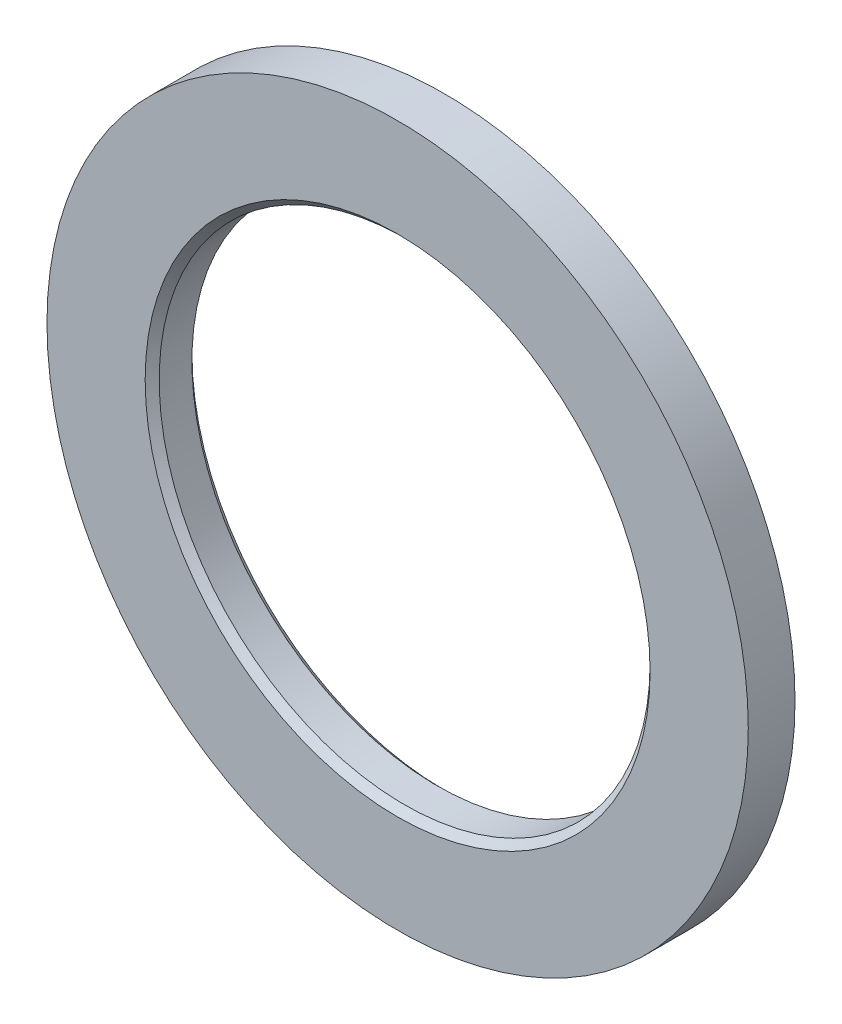
ISO-10303-21;
HEADER;
FILE_DESCRIPTION(('STEP AP214'),'2;1');
FILE_NAME('part.step','',(''),(''),'','','');
FILE_SCHEMA(('AUTOMOTIVE_DESIGN { 1 0 10303 214 1 1 1 1 }'));
ENDSEC;
DATA;
#1=APPLICATION_CONTEXT('core data for automotive mechanical design processes');
#2=APPLICATION_PROTOCOL_DEFINITION('international standard','automotive_design',2000,#1);
#3=PRODUCT_CONTEXT('',#1,'mechanical');
#4=PRODUCT('Part','Part','',(#3));
#5=PRODUCT_RELATED_PRODUCT_CATEGORY('part','',(#4));
#6=PRODUCT_DEFINITION_FORMATION('','',#4);
#7=PRODUCT_DEFINITION_CONTEXT('part definition',#1,'design');
#8=PRODUCT_DEFINITION('design','',#6,#7);
#9=PRODUCT_DEFINITION_SHAPE('','',#8);
#10=(LENGTH_UNIT() NAMED_UNIT(*) SI_UNIT(.MILLI.,.METRE.));
#11=(NAMED_UNIT(*) PLANE_ANGLE_UNIT() SI_UNIT($,.RADIAN.));
#12=(NAMED_UNIT(*) SI_UNIT($,.STERADIAN.) SOLID_ANGLE_UNIT());
#13=UNCERTAINTY_MEASURE_WITH_UNIT(LENGTH_MEASURE(1.E-05),#10,'distance_accuracy_value','');
#14=(GEOMETRIC_REPRESENTATION_CONTEXT(3) GLOBAL_UNCERTAINTY_ASSIGNED_CONTEXT((#13)) GLOBAL_UNIT_ASSIGNED_CONTEXT((#10,
#11,#12)) REPRESENTATION_CONTEXT('',''));
#15=CARTESIAN_POINT('',(0.,0.,0.));
#16=DIRECTION('',(0.,0.,1.));
#17=DIRECTION('',(1.,0.,0.));
#18=AXIS2_PLACEMENT_3D('',#15,#16,#17);
#19=CARTESIAN_POINT('',(0.,0.,5.));
#20=DIRECTION('',(0.,0.,-1.));
#21=DIRECTION('',(-1.,0.,0.));
#22=AXIS2_PLACEMENT_3D('',#19,#20,#21);
#23=CYLINDRICAL_SURFACE('',#22,37.5);
#24=CARTESIAN_POINT('',(0.,0.,5.));
#25=DIRECTION('',(0.,0.,1.));
#26=DIRECTION('',(1.,0.,0.));
#27=AXIS2_PLACEMENT_3D('',#24,#25,#26);
#28=CIRCLE('',#27,37.5);
#29=CARTESIAN_POINT('',(37.5,0.,5.));
#30=VERTEX_POINT('',#29);
#31=EDGE_CURVE('E10',#30,#30,#28,.T.);
#32=ORIENTED_EDGE('',*,*,#31,.F.);
#33=EDGE_LOOP('',(#32));
#34=FACE_BOUND('',#33,.T.);
#35=CARTESIAN_POINT('',(0.,0.,0.));
#36=DIRECTION('',(0.,0.,1.));
#37=DIRECTION('',(1.,0.,0.));
#38=AXIS2_PLACEMENT_3D('',#35,#36,#37);
#39=CIRCLE('',#38,37.5);
#40=CARTESIAN_POINT('',(37.5,0.,0.));
#41=VERTEX_POINT('',#40);
#42=EDGE_CURVE('E36',#41,#41,#39,.T.);
#43=ORIENTED_EDGE('',*,*,#42,.T.);
#44=EDGE_LOOP('',(#43));
#45=FACE_BOUND('',#44,.T.);
#46=ADVANCED_FACE('F33',(#34,#45),#23,.T.);
#47=CARTESIAN_POINT('',(0.,0.,5.));
#48=DIRECTION('',(0.,0.,1.));
#49=DIRECTION('',(1.,0.,0.));
#50=AXIS2_PLACEMENT_3D('',#47,#48,#49);
#51=PLANE('',#50);
#52=CARTESIAN_POINT('',(0.,0.,5.));
#53=DIRECTION('',(0.,0.,1.));
#54=DIRECTION('',(1.,0.,0.));
#55=AXIS2_PLACEMENT_3D('',#52,#53,#54);
#56=CIRCLE('',#55,27.);
#57=CARTESIAN_POINT('',(27.,0.,5.));
#58=VERTEX_POINT('',#57);
#59=EDGE_CURVE('E43',#58,#58,#56,.T.);
#60=ORIENTED_EDGE('',*,*,#59,.F.);
#61=EDGE_LOOP('',(#60));
#62=FACE_BOUND('',#61,.T.);
#63=ORIENTED_EDGE('',*,*,#31,.T.);
#64=EDGE_LOOP('',(#63));
#65=FACE_BOUND('',#64,.T.);
#66=ADVANCED_FACE('F78',(#62,#65),#51,.T.);
#67=CARTESIAN_POINT('',(0.,0.,0.));
#68=DIRECTION('',(0.,0.,1.));
#69=DIRECTION('',(1.,0.,0.));
#70=AXIS2_PLACEMENT_3D('',#67,#68,#69);
#71=PLANE('',#70);
#72=CARTESIAN_POINT('',(0.,0.,0.));
#73=DIRECTION('',(0.,0.,1.));
#74=DIRECTION('',(1.,0.,0.));
#75=AXIS2_PLACEMENT_3D('',#72,#73,#74);
#76=CIRCLE('',#75,27.);
#77=CARTESIAN_POINT('',(27.,0.,0.));
#78=VERTEX_POINT('',#77);
#79=EDGE_CURVE('E53',#78,#78,#76,.T.);
#80=ORIENTED_EDGE('',*,*,#79,.T.);
#81=EDGE_LOOP('',(#80));
#82=FACE_BOUND('',#81,.T.);
#83=ORIENTED_EDGE('',*,*,#42,.F.);
#84=EDGE_LOOP('',(#83));
#85=FACE_BOUND('',#84,.T.);
#86=ADVANCED_FACE('F57',(#82,#85),#71,.F.);
#87=CARTESIAN_POINT('',(0.,0.,0.));
#88=DIRECTION('',(0.,0.,1.));
#89=DIRECTION('',(1.,0.,0.));
#90=AXIS2_PLACEMENT_3D('',#87,#88,#89);
#91=CYLINDRICAL_SURFACE('',#90,26.25);
#92=CARTESIAN_POINT('',(0.,0.,0.750000000000001));
#93=DIRECTION('',(0.,0.,1.));
#94=DIRECTION('',(1.,0.,0.));
#95=AXIS2_PLACEMENT_3D('',#92,#93,#94);
#96=CIRCLE('',#95,26.25);
#97=CARTESIAN_POINT('',(26.25,0.,0.750000000000001));
#98=VERTEX_POINT('',#97);
#99=EDGE_CURVE('E50',#98,#98,#96,.T.);
#100=ORIENTED_EDGE('',*,*,#99,.F.);
#101=EDGE_LOOP('',(#100));
#102=FACE_BOUND('',#101,.T.);
#103=CARTESIAN_POINT('',(0.,0.,4.25));
#104=DIRECTION('',(0.,0.,1.));
#105=DIRECTION('',(1.,0.,0.));
#106=AXIS2_PLACEMENT_3D('',#103,#104,#105);
#107=CIRCLE('',#106,26.25);
#108=CARTESIAN_POINT('',(26.25,0.,4.25));
#109=VERTEX_POINT('',#108);
#110=EDGE_CURVE('E47',#109,#109,#107,.T.);
#111=ORIENTED_EDGE('',*,*,#110,.T.);
#112=EDGE_LOOP('',(#111));
#113=FACE_BOUND('',#112,.T.);
#114=ADVANCED_FACE('F67',(#102,#113),#91,.F.);
#115=CARTESIAN_POINT('',(0.,0.,5.));
#116=DIRECTION('',(0.,0.,1.));
#117=DIRECTION('',(1.,0.,0.));
#118=AXIS2_PLACEMENT_3D('',#115,#116,#117);
#119=CONICAL_SURFACE('',#118,27.,0.785398163397449);
#120=ORIENTED_EDGE('',*,*,#110,.F.);
#121=EDGE_LOOP('',(#120));
#122=FACE_BOUND('',#121,.T.);
#123=ORIENTED_EDGE('',*,*,#59,.T.);
#124=EDGE_LOOP('',(#123));
#125=FACE_BOUND('',#124,.T.);
#126=ADVANCED_FACE('F63',(#122,#125),#119,.F.);
#127=CARTESIAN_POINT('',(0.,0.,0.750000000000001));
#128=DIRECTION('',(0.,0.,-1.));
#129=DIRECTION('',(-1.,0.,0.));
#130=AXIS2_PLACEMENT_3D('',#127,#128,#129);
#131=CONICAL_SURFACE('',#130,26.25,0.785398163397453);
#132=ORIENTED_EDGE('',*,*,#79,.F.);
#133=EDGE_LOOP('',(#132));
#134=FACE_BOUND('',#133,.T.);
#135=ORIENTED_EDGE('',*,*,#99,.T.);
#136=EDGE_LOOP('',(#135));
#137=FACE_BOUND('',#136,.T.);
#138=ADVANCED_FACE('F60',(#134,#137),#131,.F.);
#139=CLOSED_SHELL('',(#46,#66,#86,#114,#126,#138));
#140=MANIFOLD_SOLID_BREP('B2',#139);
#141=ADVANCED_BREP_SHAPE_REPRESENTATION('',(#18,#140),#14);
#142=SHAPE_DEFINITION_REPRESENTATION(#9,#141);
ENDSEC;
END-ISO-10303-21;
